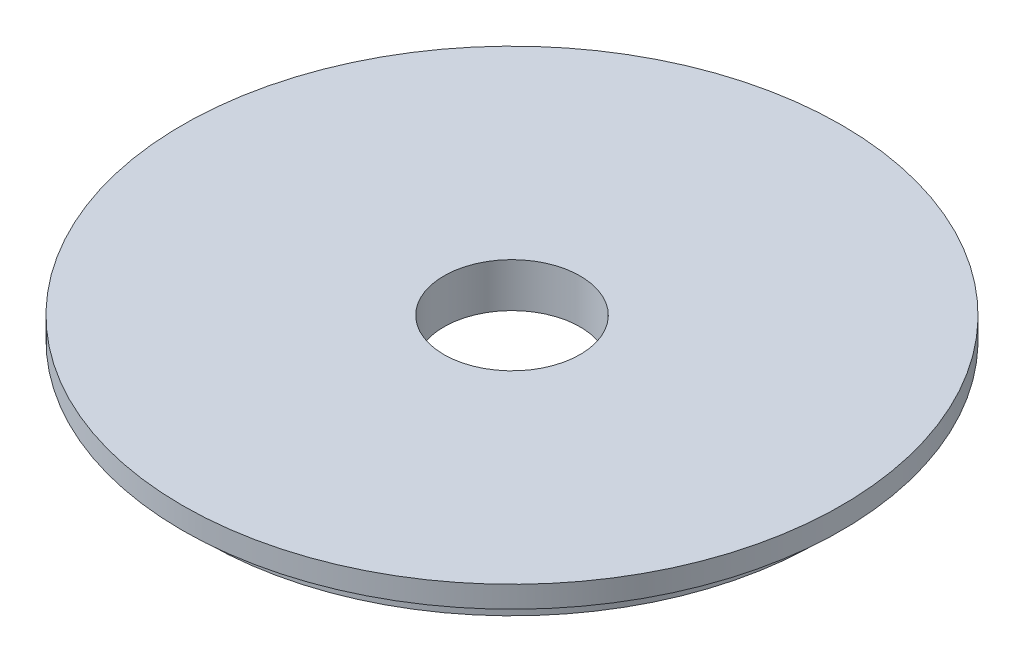
ISO-10303-21;
HEADER;
FILE_DESCRIPTION(('STEP AP214'),'2;1');
FILE_NAME('part.step','',(''),(''),'','','');
FILE_SCHEMA(('AUTOMOTIVE_DESIGN { 1 0 10303 214 1 1 1 1 }'));
ENDSEC;
DATA;
#1=APPLICATION_CONTEXT('core data for automotive mechanical design processes');
#2=APPLICATION_PROTOCOL_DEFINITION('international standard','automotive_design',2000,#1);
#3=PRODUCT_CONTEXT('',#1,'mechanical');
#4=PRODUCT('Part','Part','',(#3));
#5=PRODUCT_RELATED_PRODUCT_CATEGORY('part','',(#4));
#6=PRODUCT_DEFINITION_FORMATION('','',#4);
#7=PRODUCT_DEFINITION_CONTEXT('part definition',#1,'design');
#8=PRODUCT_DEFINITION('design','',#6,#7);
#9=PRODUCT_DEFINITION_SHAPE('','',#8);
#10=(LENGTH_UNIT() NAMED_UNIT(*) SI_UNIT(.MILLI.,.METRE.));
#11=(NAMED_UNIT(*) PLANE_ANGLE_UNIT() SI_UNIT($,.RADIAN.));
#12=(NAMED_UNIT(*) SI_UNIT($,.STERADIAN.) SOLID_ANGLE_UNIT());
#13=UNCERTAINTY_MEASURE_WITH_UNIT(LENGTH_MEASURE(1.E-05),#10,'distance_accuracy_value','');
#14=(GEOMETRIC_REPRESENTATION_CONTEXT(3) GLOBAL_UNCERTAINTY_ASSIGNED_CONTEXT((#13)) GLOBAL_UNIT_ASSIGNED_CONTEXT((#10,
#11,#12)) REPRESENTATION_CONTEXT('',''));
#15=CARTESIAN_POINT('',(0.,0.,0.));
#16=DIRECTION('',(0.,0.,1.));
#17=DIRECTION('',(1.,0.,0.));
#18=AXIS2_PLACEMENT_3D('',#15,#16,#17);
#19=CARTESIAN_POINT('',(0.,0.,0.));
#20=DIRECTION('',(0.,1.,0.));
#21=DIRECTION('',(0.,0.,1.));
#22=AXIS2_PLACEMENT_3D('',#19,#20,#21);
#23=CYLINDRICAL_SURFACE('',#22,9.525);
#24=CARTESIAN_POINT('',(0.,0.,0.));
#25=DIRECTION('',(0.,1.,0.));
#26=DIRECTION('',(0.,0.,1.));
#27=AXIS2_PLACEMENT_3D('',#24,#25,#26);
#28=CIRCLE('',#27,9.525);
#29=CARTESIAN_POINT('',(0.,0.,9.525));
#30=VERTEX_POINT('',#29);
#31=EDGE_CURVE('E10',#30,#30,#28,.T.);
#32=ORIENTED_EDGE('',*,*,#31,.T.);
#33=EDGE_LOOP('',(#32));
#34=FACE_BOUND('',#33,.T.);
#35=CARTESIAN_POINT('',(0.,-6.1722,0.));
#36=DIRECTION('',(0.,1.,0.));
#37=DIRECTION('',(0.,0.,1.));
#38=AXIS2_PLACEMENT_3D('',#35,#36,#37);
#39=CIRCLE('',#38,9.525);
#40=CARTESIAN_POINT('',(0.,-6.1722,9.525));
#41=VERTEX_POINT('',#40);
#42=EDGE_CURVE('E54',#41,#41,#39,.T.);
#43=ORIENTED_EDGE('',*,*,#42,.F.);
#44=EDGE_LOOP('',(#43));
#45=FACE_BOUND('',#44,.T.);
#46=ADVANCED_FACE('F32',(#34,#45),#23,.F.);
#47=CARTESIAN_POINT('',(-9.525,0.,0.));
#48=DIRECTION('',(0.,1.,0.));
#49=DIRECTION('',(0.,0.,1.));
#50=AXIS2_PLACEMENT_3D('',#47,#48,#49);
#51=PLANE('',#50);
#52=CARTESIAN_POINT('',(0.,0.,0.));
#53=DIRECTION('',(0.,1.,0.));
#54=DIRECTION('',(0.,0.,1.));
#55=AXIS2_PLACEMENT_3D('',#52,#53,#54);
#56=CIRCLE('',#55,46.0756);
#57=CARTESIAN_POINT('',(0.,0.,46.0756));
#58=VERTEX_POINT('',#57);
#59=EDGE_CURVE('E38',#58,#58,#56,.T.);
#60=ORIENTED_EDGE('',*,*,#59,.T.);
#61=EDGE_LOOP('',(#60));
#62=FACE_BOUND('',#61,.T.);
#63=ORIENTED_EDGE('',*,*,#31,.F.);
#64=EDGE_LOOP('',(#63));
#65=FACE_BOUND('',#64,.T.);
#66=ADVANCED_FACE('F62',(#62,#65),#51,.T.);
#67=CARTESIAN_POINT('',(0.,0.,0.));
#68=DIRECTION('',(0.,1.,0.));
#69=DIRECTION('',(0.,0.,1.));
#70=AXIS2_PLACEMENT_3D('',#67,#68,#69);
#71=CYLINDRICAL_SURFACE('',#70,46.0756);
#72=CARTESIAN_POINT('',(0.,-3.0226,0.));
#73=DIRECTION('',(0.,1.,0.));
#74=DIRECTION('',(0.,0.,1.));
#75=AXIS2_PLACEMENT_3D('',#72,#73,#74);
#76=CIRCLE('',#75,46.0756);
#77=CARTESIAN_POINT('',(0.,-3.0226,46.0756));
#78=VERTEX_POINT('',#77);
#79=EDGE_CURVE('E42',#78,#78,#76,.T.);
#80=ORIENTED_EDGE('',*,*,#79,.T.);
#81=EDGE_LOOP('',(#80));
#82=FACE_BOUND('',#81,.T.);
#83=ORIENTED_EDGE('',*,*,#59,.F.);
#84=EDGE_LOOP('',(#83));
#85=FACE_BOUND('',#84,.T.);
#86=ADVANCED_FACE('F66',(#82,#85),#71,.T.);
#87=CARTESIAN_POINT('',(-46.0756,-3.0226,0.));
#88=DIRECTION('',(0.,-1.,0.));
#89=DIRECTION('',(0.,0.,-1.));
#90=AXIS2_PLACEMENT_3D('',#87,#88,#89);
#91=PLANE('',#90);
#92=CARTESIAN_POINT('',(0.,-3.0226,0.));
#93=DIRECTION('',(0.,1.,0.));
#94=DIRECTION('',(0.,0.,1.));
#95=AXIS2_PLACEMENT_3D('',#92,#93,#94);
#96=CIRCLE('',#95,42.7482);
#97=CARTESIAN_POINT('',(0.,-3.0226,42.7482));
#98=VERTEX_POINT('',#97);
#99=EDGE_CURVE('E46',#98,#98,#96,.T.);
#100=ORIENTED_EDGE('',*,*,#99,.T.);
#101=EDGE_LOOP('',(#100));
#102=FACE_BOUND('',#101,.T.);
#103=ORIENTED_EDGE('',*,*,#79,.F.);
#104=EDGE_LOOP('',(#103));
#105=FACE_BOUND('',#104,.T.);
#106=ADVANCED_FACE('F70',(#102,#105),#91,.T.);
#107=CARTESIAN_POINT('',(0.,0.,0.));
#108=DIRECTION('',(0.,1.,0.));
#109=DIRECTION('',(0.,0.,1.));
#110=AXIS2_PLACEMENT_3D('',#107,#108,#109);
#111=CYLINDRICAL_SURFACE('',#110,42.7482);
#112=CARTESIAN_POINT('',(0.,-6.1722,0.));
#113=DIRECTION('',(0.,1.,0.));
#114=DIRECTION('',(0.,0.,1.));
#115=AXIS2_PLACEMENT_3D('',#112,#113,#114);
#116=CIRCLE('',#115,42.7482);
#117=CARTESIAN_POINT('',(0.,-6.1722,42.7482));
#118=VERTEX_POINT('',#117);
#119=EDGE_CURVE('E51',#118,#118,#116,.T.);
#120=ORIENTED_EDGE('',*,*,#119,.T.);
#121=EDGE_LOOP('',(#120));
#122=FACE_BOUND('',#121,.T.);
#123=ORIENTED_EDGE('',*,*,#99,.F.);
#124=EDGE_LOOP('',(#123));
#125=FACE_BOUND('',#124,.T.);
#126=ADVANCED_FACE('F77',(#122,#125),#111,.T.);
#127=CARTESIAN_POINT('',(-42.7482,-6.1722,0.));
#128=DIRECTION('',(0.,-1.,0.));
#129=DIRECTION('',(0.,0.,-1.));
#130=AXIS2_PLACEMENT_3D('',#127,#128,#129);
#131=PLANE('',#130);
#132=ORIENTED_EDGE('',*,*,#42,.T.);
#133=EDGE_LOOP('',(#132));
#134=FACE_BOUND('',#133,.T.);
#135=ORIENTED_EDGE('',*,*,#119,.F.);
#136=EDGE_LOOP('',(#135));
#137=FACE_BOUND('',#136,.T.);
#138=ADVANCED_FACE('F58',(#134,#137),#131,.T.);
#139=CLOSED_SHELL('',(#46,#66,#86,#106,#126,#138));
#140=MANIFOLD_SOLID_BREP('B2',#139);
#141=ADVANCED_BREP_SHAPE_REPRESENTATION('',(#18,#140),#14);
#142=SHAPE_DEFINITION_REPRESENTATION(#9,#141);
ENDSEC;
END-ISO-10303-21;
